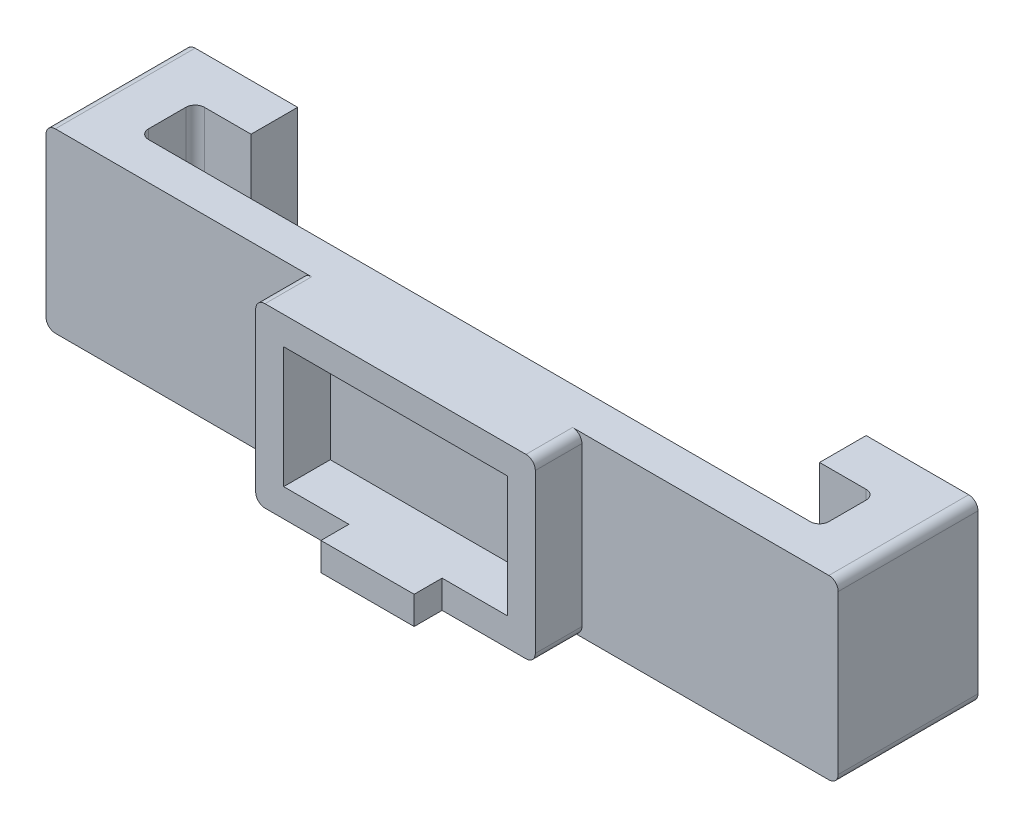
ISO-10303-21;
HEADER;
FILE_DESCRIPTION(('STEP AP214'),'2;1');
FILE_NAME('part.step','',(''),(''),'','','');
FILE_SCHEMA(('AUTOMOTIVE_DESIGN { 1 0 10303 214 1 1 1 1 }'));
ENDSEC;
DATA;
#1=APPLICATION_CONTEXT('core data for automotive mechanical design processes');
#2=APPLICATION_PROTOCOL_DEFINITION('international standard','automotive_design',2000,#1);
#3=PRODUCT_CONTEXT('',#1,'mechanical');
#4=PRODUCT('Part','Part','',(#3));
#5=PRODUCT_RELATED_PRODUCT_CATEGORY('part','',(#4));
#6=PRODUCT_DEFINITION_FORMATION('','',#4);
#7=PRODUCT_DEFINITION_CONTEXT('part definition',#1,'design');
#8=PRODUCT_DEFINITION('design','',#6,#7);
#9=PRODUCT_DEFINITION_SHAPE('','',#8);
#10=(LENGTH_UNIT() NAMED_UNIT(*) SI_UNIT(.MILLI.,.METRE.));
#11=(NAMED_UNIT(*) PLANE_ANGLE_UNIT() SI_UNIT($,.RADIAN.));
#12=(NAMED_UNIT(*) SI_UNIT($,.STERADIAN.) SOLID_ANGLE_UNIT());
#13=UNCERTAINTY_MEASURE_WITH_UNIT(LENGTH_MEASURE(1.E-05),#10,'distance_accuracy_value','');
#14=(GEOMETRIC_REPRESENTATION_CONTEXT(3) GLOBAL_UNCERTAINTY_ASSIGNED_CONTEXT((#13)) GLOBAL_UNIT_ASSIGNED_CONTEXT((#10,
#11,#12)) REPRESENTATION_CONTEXT('',''));
#15=CARTESIAN_POINT('',(0.,0.,0.));
#16=DIRECTION('',(0.,0.,1.));
#17=DIRECTION('',(1.,0.,0.));
#18=AXIS2_PLACEMENT_3D('',#15,#16,#17);
#19=CARTESIAN_POINT('',(0.,0.,-4.));
#20=DIRECTION('',(0.,0.,-1.));
#21=DIRECTION('',(-1.,0.,0.));
#22=AXIS2_PLACEMENT_3D('',#19,#20,#21);
#23=PLANE('',#22);
#24=DIRECTION('',(1.,0.,0.));
#25=VECTOR('',#24,1.);
#26=CARTESIAN_POINT('',(7.00000000000001,-2.99999999999999,-4.));
#27=LINE('',#26,#25);
#28=CARTESIAN_POINT('',(-23.5,-2.99999999999999,-4.));
#29=VERTEX_POINT('',#28);
#30=CARTESIAN_POINT('',(47.5,-3.,-4.));
#31=VERTEX_POINT('',#30);
#32=EDGE_CURVE('E417',#29,#31,#27,.T.);
#33=ORIENTED_EDGE('',*,*,#32,.F.);
#34=DIRECTION('',(0.,-1.,0.));
#35=VECTOR('',#34,1.);
#36=CARTESIAN_POINT('',(-23.5,0.,-4.));
#37=LINE('',#36,#35);
#38=CARTESIAN_POINT('',(-23.5,16.,-4.));
#39=VERTEX_POINT('',#38);
#40=EDGE_CURVE('E560',#29,#39,#37,.F.);
#41=ORIENTED_EDGE('',*,*,#40,.T.);
#42=DIRECTION('',(1.,0.,0.));
#43=VECTOR('',#42,1.);
#44=CARTESIAN_POINT('',(12.,16.,-4.));
#45=LINE('',#44,#43);
#46=CARTESIAN_POINT('',(47.5,16.,-4.));
#47=VERTEX_POINT('',#46);
#48=EDGE_CURVE('E414',#39,#47,#45,.T.);
#49=ORIENTED_EDGE('',*,*,#48,.T.);
#50=DIRECTION('',(0.,1.,0.));
#51=VECTOR('',#50,1.);
#52=CARTESIAN_POINT('',(47.5,0.,-4.));
#53=LINE('',#52,#51);
#54=EDGE_CURVE('E558',#47,#31,#53,.F.);
#55=ORIENTED_EDGE('',*,*,#54,.T.);
#56=EDGE_LOOP('',(#33,#41,#49,#55));
#57=FACE_BOUND('',#56,.T.);
#58=ADVANCED_FACE('F80',(#57),#23,.T.);
#59=CARTESIAN_POINT('',(0.,0.,5.));
#60=DIRECTION('',(0.,0.,1.));
#61=DIRECTION('',(1.,0.,0.));
#62=AXIS2_PLACEMENT_3D('',#59,#60,#61);
#63=PLANE('',#62);
#64=DIRECTION('',(0.,1.,0.));
#65=VECTOR('',#64,1.);
#66=CARTESIAN_POINT('',(27.,16.,5.));
#67=LINE('',#66,#65);
#68=CARTESIAN_POINT('',(27.,-2.,5.));
#69=VERTEX_POINT('',#68);
#70=CARTESIAN_POINT('',(27.,15.,5.));
#71=VERTEX_POINT('',#70);
#72=EDGE_CURVE('E469',#69,#71,#67,.T.);
#73=ORIENTED_EDGE('',*,*,#72,.T.);
#74=CARTESIAN_POINT('',(26.,15.,5.));
#75=DIRECTION('',(0.,0.,1.));
#76=DIRECTION('',(1.,0.,0.));
#77=AXIS2_PLACEMENT_3D('',#74,#75,#76);
#78=CIRCLE('',#77,1.);
#79=CARTESIAN_POINT('',(26.,16.,5.));
#80=VERTEX_POINT('',#79);
#81=EDGE_CURVE('E495',#71,#80,#78,.T.);
#82=ORIENTED_EDGE('',*,*,#81,.T.);
#83=DIRECTION('',(-1.,0.,0.));
#84=VECTOR('',#83,1.);
#85=CARTESIAN_POINT('',(-3.,16.,5.));
#86=LINE('',#85,#84);
#87=CARTESIAN_POINT('',(-2.,16.,5.));
#88=VERTEX_POINT('',#87);
#89=EDGE_CURVE('E472',#80,#88,#86,.T.);
#90=ORIENTED_EDGE('',*,*,#89,.T.);
#91=CARTESIAN_POINT('',(-2.,15.,5.));
#92=DIRECTION('',(0.,0.,1.));
#93=DIRECTION('',(1.,0.,0.));
#94=AXIS2_PLACEMENT_3D('',#91,#92,#93);
#95=CIRCLE('',#94,1.);
#96=CARTESIAN_POINT('',(-3.,15.,5.));
#97=VERTEX_POINT('',#96);
#98=EDGE_CURVE('E489',#88,#97,#95,.T.);
#99=ORIENTED_EDGE('',*,*,#98,.T.);
#100=DIRECTION('',(0.,-1.,0.));
#101=VECTOR('',#100,1.);
#102=CARTESIAN_POINT('',(-3.,16.,5.));
#103=LINE('',#102,#101);
#104=CARTESIAN_POINT('',(-3.,-2.,5.));
#105=VERTEX_POINT('',#104);
#106=EDGE_CURVE('E462',#97,#105,#103,.T.);
#107=ORIENTED_EDGE('',*,*,#106,.T.);
#108=CARTESIAN_POINT('',(-2.,-2.,5.));
#109=DIRECTION('',(0.,0.,1.));
#110=DIRECTION('',(1.,0.,0.));
#111=AXIS2_PLACEMENT_3D('',#108,#109,#110);
#112=CIRCLE('',#111,1.);
#113=CARTESIAN_POINT('',(-2.,-3.,5.));
#114=VERTEX_POINT('',#113);
#115=EDGE_CURVE('E491',#105,#114,#112,.T.);
#116=ORIENTED_EDGE('',*,*,#115,.T.);
#117=DIRECTION('',(1.,0.,0.));
#118=VECTOR('',#117,1.);
#119=CARTESIAN_POINT('',(-3.,-3.,5.));
#120=LINE('',#119,#118);
#121=CARTESIAN_POINT('',(7.,-3.,5.));
#122=VERTEX_POINT('',#121);
#123=EDGE_CURVE('E467',#114,#122,#120,.T.);
#124=ORIENTED_EDGE('',*,*,#123,.T.);
#125=DIRECTION('',(0.,-1.,0.));
#126=VECTOR('',#125,1.);
#127=CARTESIAN_POINT('',(7.,0.,5.));
#128=LINE('',#127,#126);
#129=CARTESIAN_POINT('',(7.,0.,5.));
#130=VERTEX_POINT('',#129);
#131=EDGE_CURVE('E345',#130,#122,#128,.T.);
#132=ORIENTED_EDGE('',*,*,#131,.F.);
#133=DIRECTION('',(1.,0.,0.));
#134=VECTOR('',#133,1.);
#135=CARTESIAN_POINT('',(0.,0.,5.));
#136=LINE('',#135,#134);
#137=CARTESIAN_POINT('',(0.,0.,5.));
#138=VERTEX_POINT('',#137);
#139=EDGE_CURVE('E330',#138,#130,#136,.T.);
#140=ORIENTED_EDGE('',*,*,#139,.F.);
#141=DIRECTION('',(0.,-1.,0.));
#142=VECTOR('',#141,1.);
#143=CARTESIAN_POINT('',(0.,0.,5.));
#144=LINE('',#143,#142);
#145=CARTESIAN_POINT('',(0.,13.,5.));
#146=VERTEX_POINT('',#145);
#147=EDGE_CURVE('E432',#146,#138,#144,.T.);
#148=ORIENTED_EDGE('',*,*,#147,.F.);
#149=DIRECTION('',(-1.,0.,0.));
#150=VECTOR('',#149,1.);
#151=CARTESIAN_POINT('',(0.,13.,5.));
#152=LINE('',#151,#150);
#153=CARTESIAN_POINT('',(24.,13.,5.));
#154=VERTEX_POINT('',#153);
#155=EDGE_CURVE('E440',#154,#146,#152,.T.);
#156=ORIENTED_EDGE('',*,*,#155,.F.);
#157=DIRECTION('',(0.,1.,0.));
#158=VECTOR('',#157,1.);
#159=CARTESIAN_POINT('',(24.,0.,5.));
#160=LINE('',#159,#158);
#161=CARTESIAN_POINT('',(24.,0.,5.));
#162=VERTEX_POINT('',#161);
#163=EDGE_CURVE('E437',#162,#154,#160,.T.);
#164=ORIENTED_EDGE('',*,*,#163,.F.);
#165=CARTESIAN_POINT('',(17.,0.,5.));
#166=VERTEX_POINT('',#165);
#167=EDGE_CURVE('E434',#166,#162,#136,.T.);
#168=ORIENTED_EDGE('',*,*,#167,.F.);
#169=DIRECTION('',(0.,1.,0.));
#170=VECTOR('',#169,1.);
#171=CARTESIAN_POINT('',(17.,0.,5.));
#172=LINE('',#171,#170);
#173=CARTESIAN_POINT('',(17.,-3.,5.));
#174=VERTEX_POINT('',#173);
#175=EDGE_CURVE('E322',#174,#166,#172,.T.);
#176=ORIENTED_EDGE('',*,*,#175,.F.);
#177=CARTESIAN_POINT('',(26.,-3.,5.));
#178=VERTEX_POINT('',#177);
#179=EDGE_CURVE('E465',#174,#178,#120,.T.);
#180=ORIENTED_EDGE('',*,*,#179,.T.);
#181=CARTESIAN_POINT('',(26.,-2.,5.));
#182=DIRECTION('',(0.,0.,1.));
#183=DIRECTION('',(1.,0.,0.));
#184=AXIS2_PLACEMENT_3D('',#181,#182,#183);
#185=CIRCLE('',#184,1.);
#186=EDGE_CURVE('E493',#178,#69,#185,.T.);
#187=ORIENTED_EDGE('',*,*,#186,.T.);
#188=EDGE_LOOP('',(#73,#82,#90,#99,#107,#116,#124,#132,#140,#148,#156,#164,#168,#176,#180,#187));
#189=FACE_BOUND('',#188,.T.);
#190=ADVANCED_FACE('F640',(#189),#63,.T.);
#191=CARTESIAN_POINT('',(-3.,16.,5.));
#192=DIRECTION('',(1.,0.,0.));
#193=DIRECTION('',(0.,1.,0.));
#194=AXIS2_PLACEMENT_3D('',#191,#192,#193);
#195=PLANE('',#194);
#196=DIRECTION('',(0.,-1.,0.));
#197=VECTOR('',#196,1.);
#198=CARTESIAN_POINT('',(-3.,16.,0.));
#199=LINE('',#198,#197);
#200=CARTESIAN_POINT('',(-3.,15.,0.));
#201=VERTEX_POINT('',#200);
#202=CARTESIAN_POINT('',(-3.,-2.,0.));
#203=VERTEX_POINT('',#202);
#204=EDGE_CURVE('E461',#201,#203,#199,.T.);
#205=ORIENTED_EDGE('',*,*,#204,.T.);
#206=DIRECTION('',(0.,0.,-1.));
#207=VECTOR('',#206,1.);
#208=CARTESIAN_POINT('',(-3.,-2.,5.));
#209=LINE('',#208,#207);
#210=EDGE_CURVE('E505',#203,#105,#209,.F.);
#211=ORIENTED_EDGE('',*,*,#210,.T.);
#212=ORIENTED_EDGE('',*,*,#106,.F.);
#213=DIRECTION('',(0.,0.,-1.));
#214=VECTOR('',#213,1.);
#215=CARTESIAN_POINT('',(-3.,15.,5.));
#216=LINE('',#215,#214);
#217=EDGE_CURVE('E502',#97,#201,#216,.T.);
#218=ORIENTED_EDGE('',*,*,#217,.T.);
#219=EDGE_LOOP('',(#205,#211,#212,#218));
#220=FACE_BOUND('',#219,.T.);
#221=ADVANCED_FACE('F630',(#220),#195,.F.);
#222=CARTESIAN_POINT('',(-3.,-3.,5.));
#223=DIRECTION('',(0.,1.,0.));
#224=DIRECTION('',(0.,0.,1.));
#225=AXIS2_PLACEMENT_3D('',#222,#223,#224);
#226=PLANE('',#225);
#227=DIRECTION('',(-1.,0.,0.));
#228=VECTOR('',#227,1.);
#229=CARTESIAN_POINT('',(54.5,-3.,-15.));
#230=LINE('',#229,#228);
#231=CARTESIAN_POINT('',(53.5,-3.,-15.));
#232=VERTEX_POINT('',#231);
#233=CARTESIAN_POINT('',(42.5,-2.99999999999999,-15.));
#234=VERTEX_POINT('',#233);
#235=EDGE_CURVE('E382',#232,#234,#230,.T.);
#236=ORIENTED_EDGE('',*,*,#235,.F.);
#237=DIRECTION('',(0.,0.,1.));
#238=VECTOR('',#237,1.);
#239=CARTESIAN_POINT('',(53.5,-3.,5.));
#240=LINE('',#239,#238);
#241=CARTESIAN_POINT('',(53.5,-2.99999999999999,0.));
#242=VERTEX_POINT('',#241);
#243=EDGE_CURVE('E537',#232,#242,#240,.T.);
#244=ORIENTED_EDGE('',*,*,#243,.T.);
#245=DIRECTION('',(-1.,0.,0.));
#246=VECTOR('',#245,1.);
#247=CARTESIAN_POINT('',(7.00000000000001,-2.99999999999999,0.));
#248=LINE('',#247,#246);
#249=CARTESIAN_POINT('',(26.,-3.,0.));
#250=VERTEX_POINT('',#249);
#251=EDGE_CURVE('E425',#242,#250,#248,.T.);
#252=ORIENTED_EDGE('',*,*,#251,.T.);
#253=DIRECTION('',(0.,0.,-1.));
#254=VECTOR('',#253,1.);
#255=CARTESIAN_POINT('',(26.,-3.,5.));
#256=LINE('',#255,#254);
#257=EDGE_CURVE('E500',#250,#178,#256,.F.);
#258=ORIENTED_EDGE('',*,*,#257,.T.);
#259=ORIENTED_EDGE('',*,*,#179,.F.);
#260=DIRECTION('',(0.,0.,-1.));
#261=VECTOR('',#260,1.);
#262=CARTESIAN_POINT('',(17.,-3.,8.));
#263=LINE('',#262,#261);
#264=CARTESIAN_POINT('',(17.,-3.,8.));
#265=VERTEX_POINT('',#264);
#266=EDGE_CURVE('E350',#265,#174,#263,.T.);
#267=ORIENTED_EDGE('',*,*,#266,.F.);
#268=DIRECTION('',(1.,0.,0.));
#269=VECTOR('',#268,1.);
#270=CARTESIAN_POINT('',(12.,-3.,8.));
#271=LINE('',#270,#269);
#272=CARTESIAN_POINT('',(7.,-3.,8.));
#273=VERTEX_POINT('',#272);
#274=EDGE_CURVE('E339',#273,#265,#271,.T.);
#275=ORIENTED_EDGE('',*,*,#274,.F.);
#276=DIRECTION('',(0.,0.,-1.));
#277=VECTOR('',#276,1.);
#278=CARTESIAN_POINT('',(7.,-3.,8.));
#279=LINE('',#278,#277);
#280=EDGE_CURVE('E334',#273,#122,#279,.T.);
#281=ORIENTED_EDGE('',*,*,#280,.T.);
#282=ORIENTED_EDGE('',*,*,#123,.F.);
#283=DIRECTION('',(0.,0.,-1.));
#284=VECTOR('',#283,1.);
#285=CARTESIAN_POINT('',(-2.,-3.,5.));
#286=LINE('',#285,#284);
#287=CARTESIAN_POINT('',(-2.,-2.99999999999999,0.));
#288=VERTEX_POINT('',#287);
#289=EDGE_CURVE('E497',#114,#288,#286,.T.);
#290=ORIENTED_EDGE('',*,*,#289,.T.);
#291=CARTESIAN_POINT('',(-29.5,-2.99999999999999,0.));
#292=VERTEX_POINT('',#291);
#293=EDGE_CURVE('E424',#288,#292,#248,.T.);
#294=ORIENTED_EDGE('',*,*,#293,.T.);
#295=DIRECTION('',(0.,0.,1.));
#296=VECTOR('',#295,1.);
#297=CARTESIAN_POINT('',(-29.5,-3.,-15.));
#298=LINE('',#297,#296);
#299=CARTESIAN_POINT('',(-29.5,-2.99999999999999,-15.));
#300=VERTEX_POINT('',#299);
#301=EDGE_CURVE('E535',#292,#300,#298,.F.);
#302=ORIENTED_EDGE('',*,*,#301,.T.);
#303=DIRECTION('',(-1.,0.,0.));
#304=VECTOR('',#303,1.);
#305=CARTESIAN_POINT('',(-18.5,-2.99999999999999,-15.));
#306=LINE('',#305,#304);
#307=CARTESIAN_POINT('',(-18.5,-2.99999999999999,-15.));
#308=VERTEX_POINT('',#307);
#309=EDGE_CURVE('E357',#308,#300,#306,.T.);
#310=ORIENTED_EDGE('',*,*,#309,.F.);
#311=DIRECTION('',(0.,0.,1.));
#312=VECTOR('',#311,1.);
#313=CARTESIAN_POINT('',(-18.5,-2.99999999999999,-15.));
#314=LINE('',#313,#312);
#315=CARTESIAN_POINT('',(-18.5,-2.99999999999999,-10.));
#316=VERTEX_POINT('',#315);
#317=EDGE_CURVE('E375',#308,#316,#314,.T.);
#318=ORIENTED_EDGE('',*,*,#317,.T.);
#319=DIRECTION('',(-1.,0.,0.));
#320=VECTOR('',#319,1.);
#321=CARTESIAN_POINT('',(-18.5,-2.99999999999999,-10.));
#322=LINE('',#321,#320);
#323=CARTESIAN_POINT('',(-23.5,-2.99999999999999,-10.));
#324=VERTEX_POINT('',#323);
#325=EDGE_CURVE('E369',#316,#324,#322,.T.);
#326=ORIENTED_EDGE('',*,*,#325,.T.);
#327=CARTESIAN_POINT('',(-23.5,-3.,-9.));
#328=DIRECTION('',(0.,1.,0.));
#329=DIRECTION('',(0.,0.,1.));
#330=AXIS2_PLACEMENT_3D('',#327,#328,#329);
#331=CIRCLE('',#330,1.);
#332=CARTESIAN_POINT('',(-24.5,-2.99999999999999,-9.));
#333=VERTEX_POINT('',#332);
#334=EDGE_CURVE('E88',#324,#333,#331,.T.);
#335=ORIENTED_EDGE('',*,*,#334,.T.);
#336=DIRECTION('',(0.,0.,1.));
#337=VECTOR('',#336,1.);
#338=CARTESIAN_POINT('',(-24.5,-2.99999999999999,-10.));
#339=LINE('',#338,#337);
#340=CARTESIAN_POINT('',(-24.5,-2.99999999999999,-5.));
#341=VERTEX_POINT('',#340);
#342=EDGE_CURVE('E404',#333,#341,#339,.T.);
#343=ORIENTED_EDGE('',*,*,#342,.T.);
#344=CARTESIAN_POINT('',(-23.5,-3.,-5.));
#345=DIRECTION('',(0.,1.,0.));
#346=DIRECTION('',(0.,0.,1.));
#347=AXIS2_PLACEMENT_3D('',#344,#345,#346);
#348=CIRCLE('',#347,1.);
#349=EDGE_CURVE('E572',#341,#29,#348,.T.);
#350=ORIENTED_EDGE('',*,*,#349,.T.);
#351=ORIENTED_EDGE('',*,*,#32,.T.);
#352=CARTESIAN_POINT('',(47.5,-3.,-5.));
#353=DIRECTION('',(0.,1.,0.));
#354=DIRECTION('',(0.,0.,1.));
#355=AXIS2_PLACEMENT_3D('',#352,#353,#354);
#356=CIRCLE('',#355,1.);
#357=CARTESIAN_POINT('',(48.5,-2.99999999999999,-5.));
#358=VERTEX_POINT('',#357);
#359=EDGE_CURVE('E578',#31,#358,#356,.T.);
#360=ORIENTED_EDGE('',*,*,#359,.T.);
#361=DIRECTION('',(0.,0.,1.));
#362=VECTOR('',#361,1.);
#363=CARTESIAN_POINT('',(48.5,-2.99999999999999,-10.));
#364=LINE('',#363,#362);
#365=CARTESIAN_POINT('',(48.5,-2.99999999999999,-9.));
#366=VERTEX_POINT('',#365);
#367=EDGE_CURVE('E410',#366,#358,#364,.T.);
#368=ORIENTED_EDGE('',*,*,#367,.F.);
#369=CARTESIAN_POINT('',(47.5,-3.,-9.));
#370=DIRECTION('',(0.,1.,0.));
#371=DIRECTION('',(0.,0.,1.));
#372=AXIS2_PLACEMENT_3D('',#369,#370,#371);
#373=CIRCLE('',#372,1.);
#374=CARTESIAN_POINT('',(47.5,-2.99999999999999,-10.));
#375=VERTEX_POINT('',#374);
#376=EDGE_CURVE('E582',#366,#375,#373,.T.);
#377=ORIENTED_EDGE('',*,*,#376,.T.);
#378=DIRECTION('',(-1.,0.,0.));
#379=VECTOR('',#378,1.);
#380=CARTESIAN_POINT('',(54.5,-3.,-10.));
#381=LINE('',#380,#379);
#382=CARTESIAN_POINT('',(42.5,-2.99999999999999,-10.));
#383=VERTEX_POINT('',#382);
#384=EDGE_CURVE('E378',#375,#383,#381,.T.);
#385=ORIENTED_EDGE('',*,*,#384,.T.);
#386=DIRECTION('',(0.,0.,1.));
#387=VECTOR('',#386,1.);
#388=CARTESIAN_POINT('',(42.5,-2.99999999999999,-15.));
#389=LINE('',#388,#387);
#390=EDGE_CURVE('E398',#234,#383,#389,.T.);
#391=ORIENTED_EDGE('',*,*,#390,.F.);
#392=EDGE_LOOP('',(#236,#244,#252,#258,#259,#267,#275,#281,#282,#290,#294,#302,#310,#318,#326,
#335,#343,#350,#351,#360,#368,#377,#385,#391));
#393=FACE_BOUND('',#392,.T.);
#394=ADVANCED_FACE('F586',(#393),#226,.F.);
#395=CARTESIAN_POINT('',(27.,16.,5.));
#396=DIRECTION('',(-1.,0.,0.));
#397=DIRECTION('',(0.,0.,1.));
#398=AXIS2_PLACEMENT_3D('',#395,#396,#397);
#399=PLANE('',#398);
#400=DIRECTION('',(0.,1.,0.));
#401=VECTOR('',#400,1.);
#402=CARTESIAN_POINT('',(27.,16.,0.));
#403=LINE('',#402,#401);
#404=CARTESIAN_POINT('',(27.,-2.,0.));
#405=VERTEX_POINT('',#404);
#406=CARTESIAN_POINT('',(27.,15.,0.));
#407=VERTEX_POINT('',#406);
#408=EDGE_CURVE('E466',#405,#407,#403,.T.);
#409=ORIENTED_EDGE('',*,*,#408,.T.);
#410=DIRECTION('',(0.,0.,-1.));
#411=VECTOR('',#410,1.);
#412=CARTESIAN_POINT('',(27.,15.,5.));
#413=LINE('',#412,#411);
#414=EDGE_CURVE('E487',#407,#71,#413,.F.);
#415=ORIENTED_EDGE('',*,*,#414,.T.);
#416=ORIENTED_EDGE('',*,*,#72,.F.);
#417=DIRECTION('',(0.,0.,-1.));
#418=VECTOR('',#417,1.);
#419=CARTESIAN_POINT('',(27.,-2.,5.));
#420=LINE('',#419,#418);
#421=EDGE_CURVE('E484',#69,#405,#420,.T.);
#422=ORIENTED_EDGE('',*,*,#421,.T.);
#423=EDGE_LOOP('',(#409,#415,#416,#422));
#424=FACE_BOUND('',#423,.T.);
#425=ADVANCED_FACE('F738',(#424),#399,.F.);
#426=CARTESIAN_POINT('',(-3.,16.,5.));
#427=DIRECTION('',(0.,-1.,0.));
#428=DIRECTION('',(0.,0.,-1.));
#429=AXIS2_PLACEMENT_3D('',#426,#427,#428);
#430=PLANE('',#429);
#431=DIRECTION('',(-1.,0.,0.));
#432=VECTOR('',#431,1.);
#433=CARTESIAN_POINT('',(12.,16.,0.));
#434=LINE('',#433,#432);
#435=CARTESIAN_POINT('',(53.5,16.,0.));
#436=VERTEX_POINT('',#435);
#437=CARTESIAN_POINT('',(26.,16.,0.));
#438=VERTEX_POINT('',#437);
#439=EDGE_CURVE('E418',#436,#438,#434,.T.);
#440=ORIENTED_EDGE('',*,*,#439,.F.);
#441=DIRECTION('',(0.,0.,1.));
#442=VECTOR('',#441,1.);
#443=CARTESIAN_POINT('',(53.5,16.,5.));
#444=LINE('',#443,#442);
#445=CARTESIAN_POINT('',(53.5,16.,-15.));
#446=VERTEX_POINT('',#445);
#447=EDGE_CURVE('E529',#436,#446,#444,.F.);
#448=ORIENTED_EDGE('',*,*,#447,.T.);
#449=DIRECTION('',(1.,0.,0.));
#450=VECTOR('',#449,1.);
#451=CARTESIAN_POINT('',(54.5,16.,-15.));
#452=LINE('',#451,#450);
#453=CARTESIAN_POINT('',(42.5,16.,-15.));
#454=VERTEX_POINT('',#453);
#455=EDGE_CURVE('E387',#454,#446,#452,.T.);
#456=ORIENTED_EDGE('',*,*,#455,.F.);
#457=DIRECTION('',(0.,0.,1.));
#458=VECTOR('',#457,1.);
#459=CARTESIAN_POINT('',(42.5,16.,-15.));
#460=LINE('',#459,#458);
#461=CARTESIAN_POINT('',(42.5,16.,-10.));
#462=VERTEX_POINT('',#461);
#463=EDGE_CURVE('E390',#454,#462,#460,.T.);
#464=ORIENTED_EDGE('',*,*,#463,.T.);
#465=DIRECTION('',(1.,0.,0.));
#466=VECTOR('',#465,1.);
#467=CARTESIAN_POINT('',(54.5,16.,-10.));
#468=LINE('',#467,#466);
#469=CARTESIAN_POINT('',(47.5,16.,-10.));
#470=VERTEX_POINT('',#469);
#471=EDGE_CURVE('E383',#462,#470,#468,.T.);
#472=ORIENTED_EDGE('',*,*,#471,.T.);
#473=CARTESIAN_POINT('',(47.5,16.,-9.));
#474=DIRECTION('',(0.,-1.,0.));
#475=DIRECTION('',(0.,0.,-1.));
#476=AXIS2_PLACEMENT_3D('',#473,#474,#475);
#477=CIRCLE('',#476,1.);
#478=CARTESIAN_POINT('',(48.5,16.,-9.));
#479=VERTEX_POINT('',#478);
#480=EDGE_CURVE('E580',#470,#479,#477,.T.);
#481=ORIENTED_EDGE('',*,*,#480,.T.);
#482=DIRECTION('',(0.,0.,1.));
#483=VECTOR('',#482,1.);
#484=CARTESIAN_POINT('',(48.5,16.,-10.));
#485=LINE('',#484,#483);
#486=CARTESIAN_POINT('',(48.5,16.,-5.));
#487=VERTEX_POINT('',#486);
#488=EDGE_CURVE('E407',#479,#487,#485,.T.);
#489=ORIENTED_EDGE('',*,*,#488,.T.);
#490=CARTESIAN_POINT('',(47.5,16.,-5.));
#491=DIRECTION('',(0.,-1.,0.));
#492=DIRECTION('',(0.,0.,-1.));
#493=AXIS2_PLACEMENT_3D('',#490,#491,#492);
#494=CIRCLE('',#493,1.);
#495=EDGE_CURVE('E576',#487,#47,#494,.T.);
#496=ORIENTED_EDGE('',*,*,#495,.T.);
#497=ORIENTED_EDGE('',*,*,#48,.F.);
#498=CARTESIAN_POINT('',(-23.5,16.,-5.));
#499=DIRECTION('',(0.,-1.,0.));
#500=DIRECTION('',(0.,0.,-1.));
#501=AXIS2_PLACEMENT_3D('',#498,#499,#500);
#502=CIRCLE('',#501,1.);
#503=CARTESIAN_POINT('',(-24.5,16.,-5.));
#504=VERTEX_POINT('',#503);
#505=EDGE_CURVE('E574',#39,#504,#502,.T.);
#506=ORIENTED_EDGE('',*,*,#505,.T.);
#507=DIRECTION('',(0.,0.,1.));
#508=VECTOR('',#507,1.);
#509=CARTESIAN_POINT('',(-24.5,16.,-10.));
#510=LINE('',#509,#508);
#511=CARTESIAN_POINT('',(-24.5,16.,-9.));
#512=VERTEX_POINT('',#511);
#513=EDGE_CURVE('E401',#512,#504,#510,.T.);
#514=ORIENTED_EDGE('',*,*,#513,.F.);
#515=CARTESIAN_POINT('',(-23.5,16.,-9.));
#516=DIRECTION('',(0.,-1.,0.));
#517=DIRECTION('',(0.,0.,-1.));
#518=AXIS2_PLACEMENT_3D('',#515,#516,#517);
#519=CIRCLE('',#518,1.);
#520=CARTESIAN_POINT('',(-23.5,16.,-10.));
#521=VERTEX_POINT('',#520);
#522=EDGE_CURVE('E12',#512,#521,#519,.T.);
#523=ORIENTED_EDGE('',*,*,#522,.T.);
#524=DIRECTION('',(1.,0.,0.));
#525=VECTOR('',#524,1.);
#526=CARTESIAN_POINT('',(-18.5,16.,-10.));
#527=LINE('',#526,#525);
#528=CARTESIAN_POINT('',(-18.5,16.,-10.));
#529=VERTEX_POINT('',#528);
#530=EDGE_CURVE('E358',#521,#529,#527,.T.);
#531=ORIENTED_EDGE('',*,*,#530,.T.);
#532=DIRECTION('',(0.,0.,1.));
#533=VECTOR('',#532,1.);
#534=CARTESIAN_POINT('',(-18.5,16.,-15.));
#535=LINE('',#534,#533);
#536=CARTESIAN_POINT('',(-18.5,16.,-15.));
#537=VERTEX_POINT('',#536);
#538=EDGE_CURVE('E366',#537,#529,#535,.T.);
#539=ORIENTED_EDGE('',*,*,#538,.F.);
#540=DIRECTION('',(1.,0.,0.));
#541=VECTOR('',#540,1.);
#542=CARTESIAN_POINT('',(-18.5,16.,-15.));
#543=LINE('',#542,#541);
#544=CARTESIAN_POINT('',(-29.5,16.,-15.));
#545=VERTEX_POINT('',#544);
#546=EDGE_CURVE('E364',#545,#537,#543,.T.);
#547=ORIENTED_EDGE('',*,*,#546,.F.);
#548=DIRECTION('',(0.,0.,1.));
#549=VECTOR('',#548,1.);
#550=CARTESIAN_POINT('',(-29.5,16.,0.));
#551=LINE('',#550,#549);
#552=CARTESIAN_POINT('',(-29.5,16.,0.));
#553=VERTEX_POINT('',#552);
#554=EDGE_CURVE('E526',#545,#553,#551,.T.);
#555=ORIENTED_EDGE('',*,*,#554,.T.);
#556=CARTESIAN_POINT('',(-2.,16.,0.));
#557=VERTEX_POINT('',#556);
#558=EDGE_CURVE('E430',#557,#553,#434,.T.);
#559=ORIENTED_EDGE('',*,*,#558,.F.);
#560=DIRECTION('',(0.,0.,-1.));
#561=VECTOR('',#560,1.);
#562=CARTESIAN_POINT('',(-2.,16.,5.));
#563=LINE('',#562,#561);
#564=EDGE_CURVE('E475',#557,#88,#563,.F.);
#565=ORIENTED_EDGE('',*,*,#564,.T.);
#566=ORIENTED_EDGE('',*,*,#89,.F.);
#567=DIRECTION('',(0.,0.,-1.));
#568=VECTOR('',#567,1.);
#569=CARTESIAN_POINT('',(26.,16.,5.));
#570=LINE('',#569,#568);
#571=EDGE_CURVE('E481',#80,#438,#570,.T.);
#572=ORIENTED_EDGE('',*,*,#571,.T.);
#573=EDGE_LOOP('',(#440,#448,#456,#464,#472,#481,#489,#496,#497,#506,#514,#523,#531,#539,#547,
#555,#559,#565,#566,#572));
#574=FACE_BOUND('',#573,.T.);
#575=ADVANCED_FACE('F595',(#574),#430,.F.);
#576=CARTESIAN_POINT('',(0.,0.,5.));
#577=DIRECTION('',(1.,0.,0.));
#578=DIRECTION('',(0.,0.,-1.));
#579=AXIS2_PLACEMENT_3D('',#576,#577,#578);
#580=PLANE('',#579);
#581=DIRECTION('',(0.,-1.,0.));
#582=VECTOR('',#581,1.);
#583=CARTESIAN_POINT('',(0.,0.,0.));
#584=LINE('',#583,#582);
#585=CARTESIAN_POINT('',(0.,13.,0.));
#586=VERTEX_POINT('',#585);
#587=CARTESIAN_POINT('',(0.,0.,0.));
#588=VERTEX_POINT('',#587);
#589=EDGE_CURVE('E421',#586,#588,#584,.T.);
#590=ORIENTED_EDGE('',*,*,#589,.F.);
#591=DIRECTION('',(0.,0.,-1.));
#592=VECTOR('',#591,1.);
#593=CARTESIAN_POINT('',(0.,13.,5.));
#594=LINE('',#593,#592);
#595=EDGE_CURVE('E442',#146,#586,#594,.T.);
#596=ORIENTED_EDGE('',*,*,#595,.F.);
#597=ORIENTED_EDGE('',*,*,#147,.T.);
#598=DIRECTION('',(0.,0.,-1.));
#599=VECTOR('',#598,1.);
#600=CARTESIAN_POINT('',(0.,0.,5.));
#601=LINE('',#600,#599);
#602=EDGE_CURVE('E458',#138,#588,#601,.T.);
#603=ORIENTED_EDGE('',*,*,#602,.T.);
#604=EDGE_LOOP('',(#590,#596,#597,#603));
#605=FACE_BOUND('',#604,.T.);
#606=ADVANCED_FACE('F732',(#605),#580,.T.);
#607=CARTESIAN_POINT('',(0.,0.,5.));
#608=DIRECTION('',(0.,1.,0.));
#609=DIRECTION('',(0.,0.,1.));
#610=AXIS2_PLACEMENT_3D('',#607,#608,#609);
#611=PLANE('',#610);
#612=DIRECTION('',(1.,0.,0.));
#613=VECTOR('',#612,1.);
#614=CARTESIAN_POINT('',(0.,0.,0.));
#615=LINE('',#614,#613);
#616=CARTESIAN_POINT('',(24.,0.,0.));
#617=VERTEX_POINT('',#616);
#618=EDGE_CURVE('E445',#588,#617,#615,.T.);
#619=ORIENTED_EDGE('',*,*,#618,.F.);
#620=ORIENTED_EDGE('',*,*,#602,.F.);
#621=ORIENTED_EDGE('',*,*,#139,.T.);
#622=DIRECTION('',(0.,0.,-1.));
#623=VECTOR('',#622,1.);
#624=CARTESIAN_POINT('',(7.,0.,8.));
#625=LINE('',#624,#623);
#626=CARTESIAN_POINT('',(7.,0.,8.));
#627=VERTEX_POINT('',#626);
#628=EDGE_CURVE('E326',#627,#130,#625,.T.);
#629=ORIENTED_EDGE('',*,*,#628,.F.);
#630=DIRECTION('',(-1.,0.,0.));
#631=VECTOR('',#630,1.);
#632=CARTESIAN_POINT('',(12.,0.,8.));
#633=LINE('',#632,#631);
#634=CARTESIAN_POINT('',(17.,0.,8.));
#635=VERTEX_POINT('',#634);
#636=EDGE_CURVE('E311',#635,#627,#633,.T.);
#637=ORIENTED_EDGE('',*,*,#636,.F.);
#638=DIRECTION('',(0.,0.,-1.));
#639=VECTOR('',#638,1.);
#640=CARTESIAN_POINT('',(17.,0.,8.));
#641=LINE('',#640,#639);
#642=EDGE_CURVE('E344',#635,#166,#641,.T.);
#643=ORIENTED_EDGE('',*,*,#642,.T.);
#644=ORIENTED_EDGE('',*,*,#167,.T.);
#645=DIRECTION('',(0.,0.,-1.));
#646=VECTOR('',#645,1.);
#647=CARTESIAN_POINT('',(24.,0.,5.));
#648=LINE('',#647,#646);
#649=EDGE_CURVE('E456',#162,#617,#648,.T.);
#650=ORIENTED_EDGE('',*,*,#649,.T.);
#651=EDGE_LOOP('',(#619,#620,#621,#629,#637,#643,#644,#650));
#652=FACE_BOUND('',#651,.T.);
#653=ADVANCED_FACE('F327',(#652),#611,.T.);
#654=CARTESIAN_POINT('',(24.,0.,5.));
#655=DIRECTION('',(-1.,0.,0.));
#656=DIRECTION('',(0.,0.,1.));
#657=AXIS2_PLACEMENT_3D('',#654,#655,#656);
#658=PLANE('',#657);
#659=DIRECTION('',(0.,1.,0.));
#660=VECTOR('',#659,1.);
#661=CARTESIAN_POINT('',(24.,0.,0.));
#662=LINE('',#661,#660);
#663=CARTESIAN_POINT('',(24.,13.,0.));
#664=VERTEX_POINT('',#663);
#665=EDGE_CURVE('E448',#617,#664,#662,.T.);
#666=ORIENTED_EDGE('',*,*,#665,.F.);
#667=ORIENTED_EDGE('',*,*,#649,.F.);
#668=ORIENTED_EDGE('',*,*,#163,.T.);
#669=DIRECTION('',(0.,0.,-1.));
#670=VECTOR('',#669,1.);
#671=CARTESIAN_POINT('',(24.,13.,5.));
#672=LINE('',#671,#670);
#673=EDGE_CURVE('E454',#154,#664,#672,.T.);
#674=ORIENTED_EDGE('',*,*,#673,.T.);
#675=EDGE_LOOP('',(#666,#667,#668,#674));
#676=FACE_BOUND('',#675,.T.);
#677=ADVANCED_FACE('F725',(#676),#658,.T.);
#678=CARTESIAN_POINT('',(0.,13.,5.));
#679=DIRECTION('',(0.,-1.,0.));
#680=DIRECTION('',(0.,0.,-1.));
#681=AXIS2_PLACEMENT_3D('',#678,#679,#680);
#682=PLANE('',#681);
#683=DIRECTION('',(-1.,0.,0.));
#684=VECTOR('',#683,1.);
#685=CARTESIAN_POINT('',(0.,13.,0.));
#686=LINE('',#685,#684);
#687=EDGE_CURVE('E435',#664,#586,#686,.T.);
#688=ORIENTED_EDGE('',*,*,#687,.F.);
#689=ORIENTED_EDGE('',*,*,#673,.F.);
#690=ORIENTED_EDGE('',*,*,#155,.T.);
#691=ORIENTED_EDGE('',*,*,#595,.T.);
#692=EDGE_LOOP('',(#688,#689,#690,#691));
#693=FACE_BOUND('',#692,.T.);
#694=ADVANCED_FACE('F722',(#693),#682,.T.);
#695=CARTESIAN_POINT('',(0.,0.,0.));
#696=DIRECTION('',(0.,0.,-1.));
#697=DIRECTION('',(-1.,0.,0.));
#698=AXIS2_PLACEMENT_3D('',#695,#696,#697);
#699=PLANE('',#698);
#700=ORIENTED_EDGE('',*,*,#687,.T.);
#701=ORIENTED_EDGE('',*,*,#589,.T.);
#702=ORIENTED_EDGE('',*,*,#618,.T.);
#703=ORIENTED_EDGE('',*,*,#665,.T.);
#704=EDGE_LOOP('',(#700,#701,#702,#703));
#705=FACE_BOUND('',#704,.T.);
#706=ADVANCED_FACE('F717',(#705),#699,.F.);
#707=DIRECTION('',(0.,-1.,0.));
#708=VECTOR('',#707,1.);
#709=CARTESIAN_POINT('',(-30.5,16.,0.));
#710=LINE('',#709,#708);
#711=CARTESIAN_POINT('',(-30.5,15.,0.));
#712=VERTEX_POINT('',#711);
#713=CARTESIAN_POINT('',(-30.5,-2.,0.));
#714=VERTEX_POINT('',#713);
#715=EDGE_CURVE('E427',#712,#714,#710,.T.);
#716=ORIENTED_EDGE('',*,*,#715,.T.);
#717=CARTESIAN_POINT('',(-29.5,-2.,0.));
#718=DIRECTION('',(0.,0.,-1.));
#719=DIRECTION('',(-1.,0.,0.));
#720=AXIS2_PLACEMENT_3D('',#717,#718,#719);
#721=CIRCLE('',#720,1.);
#722=EDGE_CURVE('E547',#714,#292,#721,.F.);
#723=ORIENTED_EDGE('',*,*,#722,.T.);
#724=ORIENTED_EDGE('',*,*,#293,.F.);
#725=CARTESIAN_POINT('',(-2.,-2.,0.));
#726=DIRECTION('',(0.,0.,-1.));
#727=DIRECTION('',(-1.,0.,0.));
#728=AXIS2_PLACEMENT_3D('',#725,#726,#727);
#729=CIRCLE('',#728,1.);
#730=EDGE_CURVE('E512',#288,#203,#729,.T.);
#731=ORIENTED_EDGE('',*,*,#730,.T.);
#732=ORIENTED_EDGE('',*,*,#204,.F.);
#733=CARTESIAN_POINT('',(-2.,15.,0.));
#734=DIRECTION('',(0.,0.,-1.));
#735=DIRECTION('',(-1.,0.,0.));
#736=AXIS2_PLACEMENT_3D('',#733,#734,#735);
#737=CIRCLE('',#736,1.);
#738=EDGE_CURVE('E514',#201,#557,#737,.T.);
#739=ORIENTED_EDGE('',*,*,#738,.T.);
#740=ORIENTED_EDGE('',*,*,#558,.T.);
#741=CARTESIAN_POINT('',(-29.5,15.,0.));
#742=DIRECTION('',(0.,0.,-1.));
#743=DIRECTION('',(-1.,0.,0.));
#744=AXIS2_PLACEMENT_3D('',#741,#742,#743);
#745=CIRCLE('',#744,1.);
#746=EDGE_CURVE('E545',#553,#712,#745,.F.);
#747=ORIENTED_EDGE('',*,*,#746,.T.);
#748=EDGE_LOOP('',(#716,#723,#724,#731,#732,#739,#740,#747));
#749=FACE_BOUND('',#748,.T.);
#750=ADVANCED_FACE('F612',(#749),#699,.F.);
#751=CARTESIAN_POINT('',(54.5,16.,-4.));
#752=DIRECTION('',(-1.,0.,0.));
#753=DIRECTION('',(0.,-1.,0.));
#754=AXIS2_PLACEMENT_3D('',#751,#752,#753);
#755=PLANE('',#754);
#756=DIRECTION('',(0.,-1.,0.));
#757=VECTOR('',#756,1.);
#758=CARTESIAN_POINT('',(54.5,16.,-15.));
#759=LINE('',#758,#757);
#760=CARTESIAN_POINT('',(54.5,15.,-15.));
#761=VERTEX_POINT('',#760);
#762=CARTESIAN_POINT('',(54.5,-2.,-15.));
#763=VERTEX_POINT('',#762);
#764=EDGE_CURVE('E379',#761,#763,#759,.T.);
#765=ORIENTED_EDGE('',*,*,#764,.F.);
#766=DIRECTION('',(0.,0.,1.));
#767=VECTOR('',#766,1.);
#768=CARTESIAN_POINT('',(54.5,15.,-4.));
#769=LINE('',#768,#767);
#770=CARTESIAN_POINT('',(54.5,15.,0.));
#771=VERTEX_POINT('',#770);
#772=EDGE_CURVE('E519',#761,#771,#769,.T.);
#773=ORIENTED_EDGE('',*,*,#772,.T.);
#774=DIRECTION('',(0.,-1.,0.));
#775=VECTOR('',#774,1.);
#776=CARTESIAN_POINT('',(54.5,16.,0.));
#777=LINE('',#776,#775);
#778=CARTESIAN_POINT('',(54.5,-2.,0.));
#779=VERTEX_POINT('',#778);
#780=EDGE_CURVE('E413',#771,#779,#777,.T.);
#781=ORIENTED_EDGE('',*,*,#780,.T.);
#782=DIRECTION('',(0.,0.,1.));
#783=VECTOR('',#782,1.);
#784=CARTESIAN_POINT('',(54.5,-2.,-4.));
#785=LINE('',#784,#783);
#786=EDGE_CURVE('E517',#779,#763,#785,.F.);
#787=ORIENTED_EDGE('',*,*,#786,.T.);
#788=EDGE_LOOP('',(#765,#773,#781,#787));
#789=FACE_BOUND('',#788,.T.);
#790=ADVANCED_FACE('F659',(#789),#755,.F.);
#791=CARTESIAN_POINT('',(-30.5,16.,-4.));
#792=DIRECTION('',(-1.,0.,0.));
#793=DIRECTION('',(0.,-1.,0.));
#794=AXIS2_PLACEMENT_3D('',#791,#792,#793);
#795=PLANE('',#794);
#796=DIRECTION('',(0.,1.,0.));
#797=VECTOR('',#796,1.);
#798=CARTESIAN_POINT('',(-30.5,16.,-15.));
#799=LINE('',#798,#797);
#800=CARTESIAN_POINT('',(-30.5,-2.,-15.));
#801=VERTEX_POINT('',#800);
#802=CARTESIAN_POINT('',(-30.5,15.,-15.));
#803=VERTEX_POINT('',#802);
#804=EDGE_CURVE('E361',#801,#803,#799,.T.);
#805=ORIENTED_EDGE('',*,*,#804,.F.);
#806=DIRECTION('',(0.,0.,1.));
#807=VECTOR('',#806,1.);
#808=CARTESIAN_POINT('',(-30.5,-2.,0.));
#809=LINE('',#808,#807);
#810=EDGE_CURVE('E542',#801,#714,#809,.T.);
#811=ORIENTED_EDGE('',*,*,#810,.T.);
#812=ORIENTED_EDGE('',*,*,#715,.F.);
#813=DIRECTION('',(0.,0.,1.));
#814=VECTOR('',#813,1.);
#815=CARTESIAN_POINT('',(-30.5,15.,-15.));
#816=LINE('',#815,#814);
#817=EDGE_CURVE('E540',#712,#803,#816,.F.);
#818=ORIENTED_EDGE('',*,*,#817,.T.);
#819=EDGE_LOOP('',(#805,#811,#812,#818));
#820=FACE_BOUND('',#819,.T.);
#821=ADVANCED_FACE('F615',(#820),#795,.T.);
#822=ORIENTED_EDGE('',*,*,#780,.F.);
#823=CARTESIAN_POINT('',(53.5,15.,0.));
#824=DIRECTION('',(0.,0.,-1.));
#825=DIRECTION('',(-1.,0.,0.));
#826=AXIS2_PLACEMENT_3D('',#823,#824,#825);
#827=CIRCLE('',#826,1.);
#828=EDGE_CURVE('E524',#771,#436,#827,.F.);
#829=ORIENTED_EDGE('',*,*,#828,.T.);
#830=ORIENTED_EDGE('',*,*,#439,.T.);
#831=CARTESIAN_POINT('',(26.,15.,0.));
#832=DIRECTION('',(0.,0.,-1.));
#833=DIRECTION('',(-1.,0.,0.));
#834=AXIS2_PLACEMENT_3D('',#831,#832,#833);
#835=CIRCLE('',#834,1.);
#836=EDGE_CURVE('E507',#438,#407,#835,.T.);
#837=ORIENTED_EDGE('',*,*,#836,.T.);
#838=ORIENTED_EDGE('',*,*,#408,.F.);
#839=CARTESIAN_POINT('',(26.,-2.,0.));
#840=DIRECTION('',(0.,0.,-1.));
#841=DIRECTION('',(-1.,0.,0.));
#842=AXIS2_PLACEMENT_3D('',#839,#840,#841);
#843=CIRCLE('',#842,1.);
#844=EDGE_CURVE('E509',#405,#250,#843,.T.);
#845=ORIENTED_EDGE('',*,*,#844,.T.);
#846=ORIENTED_EDGE('',*,*,#251,.F.);
#847=CARTESIAN_POINT('',(53.5,-2.,0.));
#848=DIRECTION('',(0.,0.,-1.));
#849=DIRECTION('',(-1.,0.,0.));
#850=AXIS2_PLACEMENT_3D('',#847,#848,#849);
#851=CIRCLE('',#850,1.);
#852=EDGE_CURVE('E522',#242,#779,#851,.F.);
#853=ORIENTED_EDGE('',*,*,#852,.T.);
#854=EDGE_LOOP('',(#822,#829,#830,#837,#838,#845,#846,#853));
#855=FACE_BOUND('',#854,.T.);
#856=ADVANCED_FACE('F714',(#855),#699,.F.);
#857=CARTESIAN_POINT('',(48.5,16.,-10.));
#858=DIRECTION('',(1.,0.,0.));
#859=DIRECTION('',(0.,0.,-1.));
#860=AXIS2_PLACEMENT_3D('',#857,#858,#859);
#861=PLANE('',#860);
#862=ORIENTED_EDGE('',*,*,#367,.T.);
#863=DIRECTION('',(0.,1.,0.));
#864=VECTOR('',#863,1.);
#865=CARTESIAN_POINT('',(48.5,16.,-5.));
#866=LINE('',#865,#864);
#867=EDGE_CURVE('E564',#358,#487,#866,.T.);
#868=ORIENTED_EDGE('',*,*,#867,.T.);
#869=ORIENTED_EDGE('',*,*,#488,.F.);
#870=DIRECTION('',(0.,1.,0.));
#871=VECTOR('',#870,1.);
#872=CARTESIAN_POINT('',(48.5,-2.99999999999999,-9.));
#873=LINE('',#872,#871);
#874=EDGE_CURVE('E562',#479,#366,#873,.F.);
#875=ORIENTED_EDGE('',*,*,#874,.T.);
#876=EDGE_LOOP('',(#862,#868,#869,#875));
#877=FACE_BOUND('',#876,.T.);
#878=ADVANCED_FACE('F683',(#877),#861,.F.);
#879=CARTESIAN_POINT('',(-24.5,16.,-10.));
#880=DIRECTION('',(-1.,0.,0.));
#881=DIRECTION('',(0.,0.,1.));
#882=AXIS2_PLACEMENT_3D('',#879,#880,#881);
#883=PLANE('',#882);
#884=ORIENTED_EDGE('',*,*,#513,.T.);
#885=DIRECTION('',(0.,-1.,0.));
#886=VECTOR('',#885,1.);
#887=CARTESIAN_POINT('',(-24.5,16.,-5.));
#888=LINE('',#887,#886);
#889=EDGE_CURVE('E555',#504,#341,#888,.T.);
#890=ORIENTED_EDGE('',*,*,#889,.T.);
#891=ORIENTED_EDGE('',*,*,#342,.F.);
#892=DIRECTION('',(0.,-1.,0.));
#893=VECTOR('',#892,1.);
#894=CARTESIAN_POINT('',(-24.5,16.,-9.));
#895=LINE('',#894,#893);
#896=EDGE_CURVE('E553',#333,#512,#895,.F.);
#897=ORIENTED_EDGE('',*,*,#896,.T.);
#898=EDGE_LOOP('',(#884,#890,#891,#897));
#899=FACE_BOUND('',#898,.T.);
#900=ADVANCED_FACE('F588',(#899),#883,.F.);
#901=CARTESIAN_POINT('',(0.,0.,-10.));
#902=DIRECTION('',(0.,0.,-1.));
#903=DIRECTION('',(-1.,0.,0.));
#904=AXIS2_PLACEMENT_3D('',#901,#902,#903);
#905=PLANE('',#904);
#906=ORIENTED_EDGE('',*,*,#384,.F.);
#907=DIRECTION('',(0.,1.,0.));
#908=VECTOR('',#907,1.);
#909=CARTESIAN_POINT('',(47.5,16.,-10.));
#910=LINE('',#909,#908);
#911=EDGE_CURVE('E567',#375,#470,#910,.T.);
#912=ORIENTED_EDGE('',*,*,#911,.T.);
#913=ORIENTED_EDGE('',*,*,#471,.F.);
#914=DIRECTION('',(0.,1.,0.));
#915=VECTOR('',#914,1.);
#916=CARTESIAN_POINT('',(42.5,16.,-10.));
#917=LINE('',#916,#915);
#918=EDGE_CURVE('E392',#383,#462,#917,.T.);
#919=ORIENTED_EDGE('',*,*,#918,.F.);
#920=EDGE_LOOP('',(#906,#912,#913,#919));
#921=FACE_BOUND('',#920,.T.);
#922=ADVANCED_FACE('F675',(#921),#905,.F.);
#923=CARTESIAN_POINT('',(42.5,16.,-15.));
#924=DIRECTION('',(1.,0.,0.));
#925=DIRECTION('',(0.,0.,-1.));
#926=AXIS2_PLACEMENT_3D('',#923,#924,#925);
#927=PLANE('',#926);
#928=ORIENTED_EDGE('',*,*,#918,.T.);
#929=ORIENTED_EDGE('',*,*,#463,.F.);
#930=DIRECTION('',(0.,1.,0.));
#931=VECTOR('',#930,1.);
#932=CARTESIAN_POINT('',(42.5,16.,-15.));
#933=LINE('',#932,#931);
#934=EDGE_CURVE('E385',#234,#454,#933,.T.);
#935=ORIENTED_EDGE('',*,*,#934,.F.);
#936=ORIENTED_EDGE('',*,*,#390,.T.);
#937=EDGE_LOOP('',(#928,#929,#935,#936));
#938=FACE_BOUND('',#937,.T.);
#939=ADVANCED_FACE('F672',(#938),#927,.F.);
#940=CARTESIAN_POINT('',(0.,0.,-15.));
#941=DIRECTION('',(0.,0.,-1.));
#942=DIRECTION('',(-1.,0.,0.));
#943=AXIS2_PLACEMENT_3D('',#940,#941,#942);
#944=PLANE('',#943);
#945=ORIENTED_EDGE('',*,*,#455,.T.);
#946=CARTESIAN_POINT('',(53.5,15.,-15.));
#947=DIRECTION('',(0.,0.,-1.));
#948=DIRECTION('',(-1.,0.,0.));
#949=AXIS2_PLACEMENT_3D('',#946,#947,#948);
#950=CIRCLE('',#949,1.);
#951=EDGE_CURVE('E533',#446,#761,#950,.T.);
#952=ORIENTED_EDGE('',*,*,#951,.T.);
#953=ORIENTED_EDGE('',*,*,#764,.T.);
#954=CARTESIAN_POINT('',(53.5,-2.,-15.));
#955=DIRECTION('',(0.,0.,-1.));
#956=DIRECTION('',(-1.,0.,0.));
#957=AXIS2_PLACEMENT_3D('',#954,#955,#956);
#958=CIRCLE('',#957,1.);
#959=EDGE_CURVE('E531',#763,#232,#958,.T.);
#960=ORIENTED_EDGE('',*,*,#959,.T.);
#961=ORIENTED_EDGE('',*,*,#235,.T.);
#962=ORIENTED_EDGE('',*,*,#934,.T.);
#963=EDGE_LOOP('',(#945,#952,#953,#960,#961,#962));
#964=FACE_BOUND('',#963,.T.);
#965=ADVANCED_FACE('F656',(#964),#944,.T.);
#966=CARTESIAN_POINT('',(-73.,0.,-10.));
#967=DIRECTION('',(0.,0.,-1.));
#968=DIRECTION('',(-1.,0.,0.));
#969=AXIS2_PLACEMENT_3D('',#966,#967,#968);
#970=PLANE('',#969);
#971=ORIENTED_EDGE('',*,*,#530,.F.);
#972=DIRECTION('',(0.,-1.,0.));
#973=VECTOR('',#972,1.);
#974=CARTESIAN_POINT('',(-23.5,-2.99999999999999,-10.));
#975=LINE('',#974,#973);
#976=EDGE_CURVE('E570',#521,#324,#975,.T.);
#977=ORIENTED_EDGE('',*,*,#976,.T.);
#978=ORIENTED_EDGE('',*,*,#325,.F.);
#979=DIRECTION('',(0.,-1.,0.));
#980=VECTOR('',#979,1.);
#981=CARTESIAN_POINT('',(-18.5,16.,-10.));
#982=LINE('',#981,#980);
#983=EDGE_CURVE('E333',#529,#316,#982,.T.);
#984=ORIENTED_EDGE('',*,*,#983,.F.);
#985=EDGE_LOOP('',(#971,#977,#978,#984));
#986=FACE_BOUND('',#985,.T.);
#987=ADVANCED_FACE('F591',(#986),#970,.F.);
#988=CARTESIAN_POINT('',(-18.5,16.,-15.));
#989=DIRECTION('',(-1.,0.,0.));
#990=DIRECTION('',(0.,0.,1.));
#991=AXIS2_PLACEMENT_3D('',#988,#989,#990);
#992=PLANE('',#991);
#993=ORIENTED_EDGE('',*,*,#983,.T.);
#994=ORIENTED_EDGE('',*,*,#317,.F.);
#995=DIRECTION('',(0.,-1.,0.));
#996=VECTOR('',#995,1.);
#997=CARTESIAN_POINT('',(-18.5,16.,-15.));
#998=LINE('',#997,#996);
#999=EDGE_CURVE('E354',#537,#308,#998,.T.);
#1000=ORIENTED_EDGE('',*,*,#999,.F.);
#1001=ORIENTED_EDGE('',*,*,#538,.T.);
#1002=EDGE_LOOP('',(#993,#994,#1000,#1001));
#1003=FACE_BOUND('',#1002,.T.);
#1004=ADVANCED_FACE('F599',(#1003),#992,.F.);
#1005=CARTESIAN_POINT('',(-73.,0.,-15.));
#1006=DIRECTION('',(0.,0.,-1.));
#1007=DIRECTION('',(-1.,0.,0.));
#1008=AXIS2_PLACEMENT_3D('',#1005,#1006,#1007);
#1009=PLANE('',#1008);
#1010=ORIENTED_EDGE('',*,*,#309,.T.);
#1011=CARTESIAN_POINT('',(-29.5,-2.,-15.));
#1012=DIRECTION('',(0.,0.,-1.));
#1013=DIRECTION('',(-1.,0.,0.));
#1014=AXIS2_PLACEMENT_3D('',#1011,#1012,#1013);
#1015=CIRCLE('',#1014,1.);
#1016=EDGE_CURVE('E551',#300,#801,#1015,.T.);
#1017=ORIENTED_EDGE('',*,*,#1016,.T.);
#1018=ORIENTED_EDGE('',*,*,#804,.T.);
#1019=CARTESIAN_POINT('',(-29.5,15.,-15.));
#1020=DIRECTION('',(0.,0.,-1.));
#1021=DIRECTION('',(-1.,0.,0.));
#1022=AXIS2_PLACEMENT_3D('',#1019,#1020,#1021);
#1023=CIRCLE('',#1022,1.);
#1024=EDGE_CURVE('E549',#803,#545,#1023,.T.);
#1025=ORIENTED_EDGE('',*,*,#1024,.T.);
#1026=ORIENTED_EDGE('',*,*,#546,.T.);
#1027=ORIENTED_EDGE('',*,*,#999,.T.);
#1028=EDGE_LOOP('',(#1010,#1017,#1018,#1025,#1026,#1027));
#1029=FACE_BOUND('',#1028,.T.);
#1030=ADVANCED_FACE('F602',(#1029),#1009,.T.);
#1031=CARTESIAN_POINT('',(7.,0.,8.));
#1032=DIRECTION('',(1.,0.,0.));
#1033=DIRECTION('',(0.,0.,-1.));
#1034=AXIS2_PLACEMENT_3D('',#1031,#1032,#1033);
#1035=PLANE('',#1034);
#1036=ORIENTED_EDGE('',*,*,#131,.T.);
#1037=ORIENTED_EDGE('',*,*,#280,.F.);
#1038=DIRECTION('',(0.,-1.,0.));
#1039=VECTOR('',#1038,1.);
#1040=CARTESIAN_POINT('',(7.,0.,8.));
#1041=LINE('',#1040,#1039);
#1042=EDGE_CURVE('E315',#627,#273,#1041,.T.);
#1043=ORIENTED_EDGE('',*,*,#1042,.F.);
#1044=ORIENTED_EDGE('',*,*,#628,.T.);
#1045=EDGE_LOOP('',(#1036,#1037,#1043,#1044));
#1046=FACE_BOUND('',#1045,.T.);
#1047=ADVANCED_FACE('F336',(#1046),#1035,.F.);
#1048=CARTESIAN_POINT('',(17.,0.,8.));
#1049=DIRECTION('',(-1.,0.,0.));
#1050=DIRECTION('',(0.,0.,1.));
#1051=AXIS2_PLACEMENT_3D('',#1048,#1049,#1050);
#1052=PLANE('',#1051);
#1053=ORIENTED_EDGE('',*,*,#175,.T.);
#1054=ORIENTED_EDGE('',*,*,#642,.F.);
#1055=DIRECTION('',(0.,1.,0.));
#1056=VECTOR('',#1055,1.);
#1057=CARTESIAN_POINT('',(17.,0.,8.));
#1058=LINE('',#1057,#1056);
#1059=EDGE_CURVE('E318',#265,#635,#1058,.T.);
#1060=ORIENTED_EDGE('',*,*,#1059,.F.);
#1061=ORIENTED_EDGE('',*,*,#266,.T.);
#1062=EDGE_LOOP('',(#1053,#1054,#1060,#1061));
#1063=FACE_BOUND('',#1062,.T.);
#1064=ADVANCED_FACE('F877',(#1063),#1052,.F.);
#1065=CARTESIAN_POINT('',(0.,0.,8.));
#1066=DIRECTION('',(0.,0.,-1.));
#1067=DIRECTION('',(-1.,0.,0.));
#1068=AXIS2_PLACEMENT_3D('',#1065,#1066,#1067);
#1069=PLANE('',#1068);
#1070=ORIENTED_EDGE('',*,*,#636,.T.);
#1071=ORIENTED_EDGE('',*,*,#1042,.T.);
#1072=ORIENTED_EDGE('',*,*,#274,.T.);
#1073=ORIENTED_EDGE('',*,*,#1059,.T.);
#1074=EDGE_LOOP('',(#1070,#1071,#1072,#1073));
#1075=FACE_BOUND('',#1074,.T.);
#1076=ADVANCED_FACE('F313',(#1075),#1069,.F.);
#1077=CARTESIAN_POINT('',(26.,15.,5.));
#1078=DIRECTION('',(0.,0.,-1.));
#1079=DIRECTION('',(-1.,0.,0.));
#1080=AXIS2_PLACEMENT_3D('',#1077,#1078,#1079);
#1081=CYLINDRICAL_SURFACE('',#1080,1.);
#1082=ORIENTED_EDGE('',*,*,#81,.F.);
#1083=ORIENTED_EDGE('',*,*,#414,.F.);
#1084=ORIENTED_EDGE('',*,*,#836,.F.);
#1085=ORIENTED_EDGE('',*,*,#571,.F.);
#1086=EDGE_LOOP('',(#1082,#1083,#1084,#1085));
#1087=FACE_BOUND('',#1086,.T.);
#1088=ADVANCED_FACE('F645',(#1087),#1081,.T.);
#1089=CARTESIAN_POINT('',(26.,-2.,5.));
#1090=DIRECTION('',(0.,0.,-1.));
#1091=DIRECTION('',(-1.,0.,0.));
#1092=AXIS2_PLACEMENT_3D('',#1089,#1090,#1091);
#1093=CYLINDRICAL_SURFACE('',#1092,1.);
#1094=ORIENTED_EDGE('',*,*,#186,.F.);
#1095=ORIENTED_EDGE('',*,*,#257,.F.);
#1096=ORIENTED_EDGE('',*,*,#844,.F.);
#1097=ORIENTED_EDGE('',*,*,#421,.F.);
#1098=EDGE_LOOP('',(#1094,#1095,#1096,#1097));
#1099=FACE_BOUND('',#1098,.T.);
#1100=ADVANCED_FACE('F748',(#1099),#1093,.T.);
#1101=CARTESIAN_POINT('',(-2.,-2.,5.));
#1102=DIRECTION('',(0.,0.,-1.));
#1103=DIRECTION('',(-1.,0.,0.));
#1104=AXIS2_PLACEMENT_3D('',#1101,#1102,#1103);
#1105=CYLINDRICAL_SURFACE('',#1104,1.);
#1106=ORIENTED_EDGE('',*,*,#115,.F.);
#1107=ORIENTED_EDGE('',*,*,#210,.F.);
#1108=ORIENTED_EDGE('',*,*,#730,.F.);
#1109=ORIENTED_EDGE('',*,*,#289,.F.);
#1110=EDGE_LOOP('',(#1106,#1107,#1108,#1109));
#1111=FACE_BOUND('',#1110,.T.);
#1112=ADVANCED_FACE('F626',(#1111),#1105,.T.);
#1113=CARTESIAN_POINT('',(-2.,15.,5.));
#1114=DIRECTION('',(0.,0.,-1.));
#1115=DIRECTION('',(-1.,0.,0.));
#1116=AXIS2_PLACEMENT_3D('',#1113,#1114,#1115);
#1117=CYLINDRICAL_SURFACE('',#1116,1.);
#1118=ORIENTED_EDGE('',*,*,#98,.F.);
#1119=ORIENTED_EDGE('',*,*,#564,.F.);
#1120=ORIENTED_EDGE('',*,*,#738,.F.);
#1121=ORIENTED_EDGE('',*,*,#217,.F.);
#1122=EDGE_LOOP('',(#1118,#1119,#1120,#1121));
#1123=FACE_BOUND('',#1122,.T.);
#1124=ADVANCED_FACE('F635',(#1123),#1117,.T.);
#1125=CARTESIAN_POINT('',(53.5,15.,-4.));
#1126=DIRECTION('',(0.,0.,1.));
#1127=DIRECTION('',(1.,0.,0.));
#1128=AXIS2_PLACEMENT_3D('',#1125,#1126,#1127);
#1129=CYLINDRICAL_SURFACE('',#1128,1.);
#1130=ORIENTED_EDGE('',*,*,#951,.F.);
#1131=ORIENTED_EDGE('',*,*,#447,.F.);
#1132=ORIENTED_EDGE('',*,*,#828,.F.);
#1133=ORIENTED_EDGE('',*,*,#772,.F.);
#1134=EDGE_LOOP('',(#1130,#1131,#1132,#1133));
#1135=FACE_BOUND('',#1134,.T.);
#1136=ADVANCED_FACE('F652',(#1135),#1129,.T.);
#1137=CARTESIAN_POINT('',(53.5,-2.,5.));
#1138=DIRECTION('',(0.,0.,1.));
#1139=DIRECTION('',(1.,0.,0.));
#1140=AXIS2_PLACEMENT_3D('',#1137,#1138,#1139);
#1141=CYLINDRICAL_SURFACE('',#1140,1.);
#1142=ORIENTED_EDGE('',*,*,#959,.F.);
#1143=ORIENTED_EDGE('',*,*,#786,.F.);
#1144=ORIENTED_EDGE('',*,*,#852,.F.);
#1145=ORIENTED_EDGE('',*,*,#243,.F.);
#1146=EDGE_LOOP('',(#1142,#1143,#1144,#1145));
#1147=FACE_BOUND('',#1146,.T.);
#1148=ADVANCED_FACE('F663',(#1147),#1141,.T.);
#1149=CARTESIAN_POINT('',(-29.5,-2.,-4.));
#1150=DIRECTION('',(0.,0.,-1.));
#1151=DIRECTION('',(-1.,0.,0.));
#1152=AXIS2_PLACEMENT_3D('',#1149,#1150,#1151);
#1153=CYLINDRICAL_SURFACE('',#1152,1.);
#1154=ORIENTED_EDGE('',*,*,#1016,.F.);
#1155=ORIENTED_EDGE('',*,*,#301,.F.);
#1156=ORIENTED_EDGE('',*,*,#722,.F.);
#1157=ORIENTED_EDGE('',*,*,#810,.F.);
#1158=EDGE_LOOP('',(#1154,#1155,#1156,#1157));
#1159=FACE_BOUND('',#1158,.T.);
#1160=ADVANCED_FACE('F618',(#1159),#1153,.T.);
#1161=CARTESIAN_POINT('',(-29.5,15.,5.));
#1162=DIRECTION('',(0.,0.,-1.));
#1163=DIRECTION('',(-1.,0.,0.));
#1164=AXIS2_PLACEMENT_3D('',#1161,#1162,#1163);
#1165=CYLINDRICAL_SURFACE('',#1164,1.);
#1166=ORIENTED_EDGE('',*,*,#1024,.F.);
#1167=ORIENTED_EDGE('',*,*,#817,.F.);
#1168=ORIENTED_EDGE('',*,*,#746,.F.);
#1169=ORIENTED_EDGE('',*,*,#554,.F.);
#1170=EDGE_LOOP('',(#1166,#1167,#1168,#1169));
#1171=FACE_BOUND('',#1170,.T.);
#1172=ADVANCED_FACE('F608',(#1171),#1165,.T.);
#1173=CARTESIAN_POINT('',(-23.5,16.,-5.));
#1174=DIRECTION('',(0.,-1.,0.));
#1175=DIRECTION('',(0.,0.,-1.));
#1176=AXIS2_PLACEMENT_3D('',#1173,#1174,#1175);
#1177=CYLINDRICAL_SURFACE('',#1176,1.);
#1178=ORIENTED_EDGE('',*,*,#505,.F.);
#1179=ORIENTED_EDGE('',*,*,#40,.F.);
#1180=ORIENTED_EDGE('',*,*,#349,.F.);
#1181=ORIENTED_EDGE('',*,*,#889,.F.);
#1182=EDGE_LOOP('',(#1178,#1179,#1180,#1181));
#1183=FACE_BOUND('',#1182,.T.);
#1184=ADVANCED_FACE('F696',(#1183),#1177,.F.);
#1185=CARTESIAN_POINT('',(47.5,16.,-5.));
#1186=DIRECTION('',(0.,1.,0.));
#1187=DIRECTION('',(0.,0.,1.));
#1188=AXIS2_PLACEMENT_3D('',#1185,#1186,#1187);
#1189=CYLINDRICAL_SURFACE('',#1188,1.);
#1190=ORIENTED_EDGE('',*,*,#359,.F.);
#1191=ORIENTED_EDGE('',*,*,#54,.F.);
#1192=ORIENTED_EDGE('',*,*,#495,.F.);
#1193=ORIENTED_EDGE('',*,*,#867,.F.);
#1194=EDGE_LOOP('',(#1190,#1191,#1192,#1193));
#1195=FACE_BOUND('',#1194,.T.);
#1196=ADVANCED_FACE('F688',(#1195),#1189,.F.);
#1197=CARTESIAN_POINT('',(47.5,0.,-9.));
#1198=DIRECTION('',(0.,-1.,0.));
#1199=DIRECTION('',(0.,0.,-1.));
#1200=AXIS2_PLACEMENT_3D('',#1197,#1198,#1199);
#1201=CYLINDRICAL_SURFACE('',#1200,1.);
#1202=ORIENTED_EDGE('',*,*,#376,.F.);
#1203=ORIENTED_EDGE('',*,*,#874,.F.);
#1204=ORIENTED_EDGE('',*,*,#480,.F.);
#1205=ORIENTED_EDGE('',*,*,#911,.F.);
#1206=EDGE_LOOP('',(#1202,#1203,#1204,#1205));
#1207=FACE_BOUND('',#1206,.T.);
#1208=ADVANCED_FACE('F679',(#1207),#1201,.F.);
#1209=CARTESIAN_POINT('',(-23.5,0.,-9.));
#1210=DIRECTION('',(0.,1.,0.));
#1211=DIRECTION('',(0.,0.,1.));
#1212=AXIS2_PLACEMENT_3D('',#1209,#1210,#1211);
#1213=CYLINDRICAL_SURFACE('',#1212,1.);
#1214=ORIENTED_EDGE('',*,*,#522,.F.);
#1215=ORIENTED_EDGE('',*,*,#896,.F.);
#1216=ORIENTED_EDGE('',*,*,#334,.F.);
#1217=ORIENTED_EDGE('',*,*,#976,.F.);
#1218=EDGE_LOOP('',(#1214,#1215,#1216,#1217));
#1219=FACE_BOUND('',#1218,.T.);
#1220=ADVANCED_FACE('F82',(#1219),#1213,.F.);
#1221=CLOSED_SHELL('',(#58,#190,#221,#394,#425,#575,#606,#653,#677,#694,#706,#750,#790,#821,
#856,#878,#900,#922,#939,#965,#987,#1004,#1030,#1047,#1064,#1076,#1088,#1100,#1112,#1124,#1136,
#1148,#1160,#1172,#1184,#1196,#1208,#1220));
#1222=MANIFOLD_SOLID_BREP('B2',#1221);
#1223=ADVANCED_BREP_SHAPE_REPRESENTATION('',(#18,#1222),#14);
#1224=SHAPE_DEFINITION_REPRESENTATION(#9,#1223);
ENDSEC;
END-ISO-10303-21;
